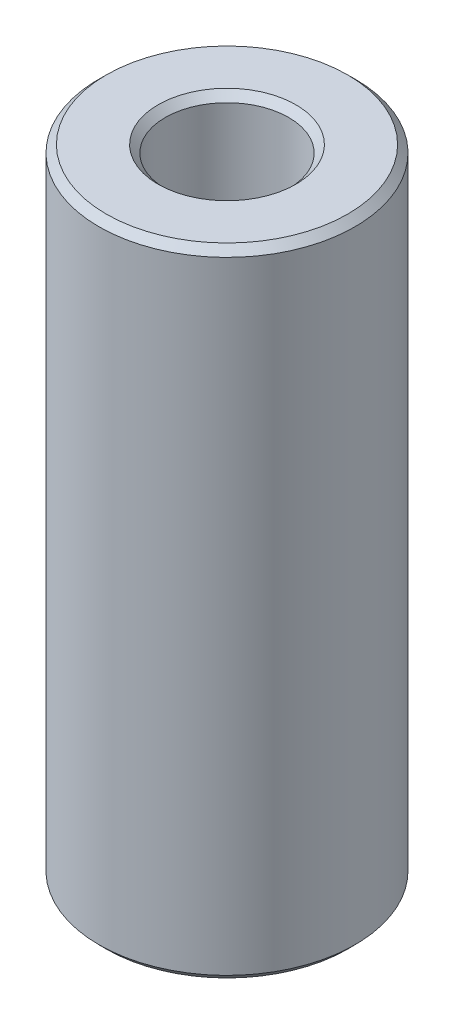
ISO-10303-21;
HEADER;
FILE_DESCRIPTION(('STEP AP214'),'2;1');
FILE_NAME('part.step','',(''),(''),'','','');
FILE_SCHEMA(('AUTOMOTIVE_DESIGN { 1 0 10303 214 1 1 1 1 }'));
ENDSEC;
DATA;
#1=APPLICATION_CONTEXT('core data for automotive mechanical design processes');
#2=APPLICATION_PROTOCOL_DEFINITION('international standard','automotive_design',2000,#1);
#3=PRODUCT_CONTEXT('',#1,'mechanical');
#4=PRODUCT('Part','Part','',(#3));
#5=PRODUCT_RELATED_PRODUCT_CATEGORY('part','',(#4));
#6=PRODUCT_DEFINITION_FORMATION('','',#4);
#7=PRODUCT_DEFINITION_CONTEXT('part definition',#1,'design');
#8=PRODUCT_DEFINITION('design','',#6,#7);
#9=PRODUCT_DEFINITION_SHAPE('','',#8);
#10=(LENGTH_UNIT() NAMED_UNIT(*) SI_UNIT(.MILLI.,.METRE.));
#11=(NAMED_UNIT(*) PLANE_ANGLE_UNIT() SI_UNIT($,.RADIAN.));
#12=(NAMED_UNIT(*) SI_UNIT($,.STERADIAN.) SOLID_ANGLE_UNIT());
#13=UNCERTAINTY_MEASURE_WITH_UNIT(LENGTH_MEASURE(1.E-05),#10,'distance_accuracy_value','');
#14=(GEOMETRIC_REPRESENTATION_CONTEXT(3) GLOBAL_UNCERTAINTY_ASSIGNED_CONTEXT((#13)) GLOBAL_UNIT_ASSIGNED_CONTEXT((#10,
#11,#12)) REPRESENTATION_CONTEXT('',''));
#15=CARTESIAN_POINT('',(0.,0.,0.));
#16=DIRECTION('',(0.,0.,1.));
#17=DIRECTION('',(1.,0.,0.));
#18=AXIS2_PLACEMENT_3D('',#15,#16,#17);
#19=CARTESIAN_POINT('',(0.,211.299643376169,0.));
#20=DIRECTION('',(0.,-1.,0.));
#21=DIRECTION('',(0.,0.,-1.));
#22=AXIS2_PLACEMENT_3D('',#19,#20,#21);
#23=CYLINDRICAL_SURFACE('',#22,42.5);
#24=CARTESIAN_POINT('',(0.,2.44716220224878,0.));
#25=DIRECTION('',(0.,1.,0.));
#26=DIRECTION('',(0.,0.,1.));
#27=AXIS2_PLACEMENT_3D('',#24,#25,#26);
#28=CIRCLE('',#27,42.5);
#29=CARTESIAN_POINT('',(0.,2.44716220224875,-42.5));
#30=VERTEX_POINT('',#29);
#31=EDGE_CURVE('E10',#30,#30,#28,.T.);
#32=CARTESIAN_POINT('',(0.,208.890496954962,0.));
#33=DIRECTION('',(0.,1.,0.));
#34=DIRECTION('',(0.,0.,1.));
#35=AXIS2_PLACEMENT_3D('',#32,#33,#34);
#36=CIRCLE('',#35,42.5);
#37=CARTESIAN_POINT('',(0.,208.890496954962,-42.5));
#38=VERTEX_POINT('',#37);
#39=EDGE_CURVE('E50',#38,#38,#36,.F.);
#40=CARTESIAN_POINT('',(0.,2.44716220224875,-42.5));
#41=CARTESIAN_POINT('',(0.,4.59761360592285,-42.5));
#42=CARTESIAN_POINT('',(0.,6.74806500959695,-42.5));
#43=CARTESIAN_POINT('',(0.,11.0489678169451,-42.5));
#44=CARTESIAN_POINT('',(0.,13.1994192206192,-42.5));
#45=CARTESIAN_POINT('',(0.,17.5003220279674,-42.5));
#46=CARTESIAN_POINT('',(0.,19.6507734316415,-42.5));
#47=CARTESIAN_POINT('',(0.,23.9516762389897,-42.5));
#48=CARTESIAN_POINT('',(0.,26.1021276426638,-42.5));
#49=CARTESIAN_POINT('',(0.,30.403030450012,-42.5));
#50=CARTESIAN_POINT('',(0.,32.5534818536861,-42.5));
#51=CARTESIAN_POINT('',(0.,36.8543846610343,-42.5));
#52=CARTESIAN_POINT('',(0.,39.0048360647084,-42.5));
#53=CARTESIAN_POINT('',(0.,43.3057388720566,-42.5));
#54=CARTESIAN_POINT('',(0.,45.4561902757307,-42.5));
#55=CARTESIAN_POINT('',(0.,49.7570930830789,-42.5));
#56=CARTESIAN_POINT('',(0.,51.907544486753,-42.5));
#57=CARTESIAN_POINT('',(0.,56.2084472941012,-42.5));
#58=CARTESIAN_POINT('',(0.,58.3588986977753,-42.5));
#59=CARTESIAN_POINT('',(0.,62.6598015051235,-42.5));
#60=CARTESIAN_POINT('',(0.,64.8102529087976,-42.5));
#61=CARTESIAN_POINT('',(0.,69.1111557161458,-42.5));
#62=CARTESIAN_POINT('',(0.,71.2616071198199,-42.5));
#63=CARTESIAN_POINT('',(0.,75.5625099271681,-42.5));
#64=CARTESIAN_POINT('',(0.,77.7129613308422,-42.5));
#65=CARTESIAN_POINT('',(0.,82.0138641381904,-42.5));
#66=CARTESIAN_POINT('',(0.,84.1643155418645,-42.5));
#67=CARTESIAN_POINT('',(0.,88.4652183492127,-42.5));
#68=CARTESIAN_POINT('',(0.,90.6156697528868,-42.5));
#69=CARTESIAN_POINT('',(0.,94.916572560235,-42.5));
#70=CARTESIAN_POINT('',(0.,97.0670239639091,-42.5));
#71=CARTESIAN_POINT('',(0.,101.367926771257,-42.5));
#72=CARTESIAN_POINT('',(0.,103.518378174931,-42.5));
#73=CARTESIAN_POINT('',(0.,107.81928098228,-42.5));
#74=CARTESIAN_POINT('',(0.,109.969732385954,-42.5));
#75=CARTESIAN_POINT('',(0.,114.270635193302,-42.5));
#76=CARTESIAN_POINT('',(0.,116.421086596976,-42.5));
#77=CARTESIAN_POINT('',(0.,120.721989404324,-42.5));
#78=CARTESIAN_POINT('',(0.,122.872440807998,-42.5));
#79=CARTESIAN_POINT('',(0.,127.173343615346,-42.5));
#80=CARTESIAN_POINT('',(0.,129.323795019021,-42.5));
#81=CARTESIAN_POINT('',(0.,133.624697826369,-42.5));
#82=CARTESIAN_POINT('',(0.,135.775149230043,-42.5));
#83=CARTESIAN_POINT('',(0.,140.076052037391,-42.5));
#84=CARTESIAN_POINT('',(0.,142.226503441065,-42.5));
#85=CARTESIAN_POINT('',(0.,146.527406248413,-42.5));
#86=CARTESIAN_POINT('',(0.,148.677857652087,-42.5));
#87=CARTESIAN_POINT('',(0.,152.978760459436,-42.5));
#88=CARTESIAN_POINT('',(0.,155.12921186311,-42.5));
#89=CARTESIAN_POINT('',(0.,159.430114670458,-42.5));
#90=CARTESIAN_POINT('',(0.,161.580566074132,-42.5));
#91=CARTESIAN_POINT('',(0.,165.88146888148,-42.5));
#92=CARTESIAN_POINT('',(0.,168.031920285154,-42.5));
#93=CARTESIAN_POINT('',(0.,172.332823092502,-42.5));
#94=CARTESIAN_POINT('',(0.,174.483274496177,-42.5));
#95=CARTESIAN_POINT('',(0.,178.784177303525,-42.5));
#96=CARTESIAN_POINT('',(0.,180.934628707199,-42.5));
#97=CARTESIAN_POINT('',(0.,185.235531514547,-42.5));
#98=CARTESIAN_POINT('',(0.,187.385982918221,-42.5));
#99=CARTESIAN_POINT('',(0.,191.686885725569,-42.5));
#100=CARTESIAN_POINT('',(0.,193.837337129243,-42.5));
#101=CARTESIAN_POINT('',(0.,198.138239936592,-42.5));
#102=CARTESIAN_POINT('',(0.,200.288691340266,-42.5));
#103=CARTESIAN_POINT('',(0.,204.589594147614,-42.5));
#104=CARTESIAN_POINT('',(0.,206.740045551288,-42.5));
#105=CARTESIAN_POINT('',(0.,208.890496954962,-42.5));
#106=B_SPLINE_CURVE_WITH_KNOTS('',3,(#40,#41,#42,#43,#44,#45,#46,#47,#48,#49,#50,#51,#52,#53,
#54,#55,#56,#57,#58,#59,#60,#61,#62,#63,#64,#65,#66,#67,#68,#69,#70,#71,#72,#73,#74,#75,#76,#77,
#78,#79,#80,#81,#82,#83,#84,#85,#86,#87,#88,#89,#90,#91,#92,#93,#94,#95,#96,#97,#98,#99,#100,
#101,#102,#103,#104,#105),.UNSPECIFIED.,.F.,.F.,(4,2,2,2,2,2,2,2,2,2,2,2,2,2,2,2,2,2,2,2,2,2,2,
2,2,2,2,2,2,2,2,2,4),(0.,6.4513542110223,12.9027084220446,19.3540626330669,25.8054168440892,
32.2567710551115,38.7081252661338,45.1594794771561,51.6108336881784,58.0621878992006,
64.5135421102229,70.9648963212452,77.4162505322675,83.8676047432898,90.3189589543121,
96.7703131653344,103.221667376357,109.673021587379,116.124375798401,122.575730009424,
129.027084220446,135.478438431468,141.92979264249,148.381146853513,154.832501064535,
161.283855275557,167.73520948658,174.186563697602,180.637917908624,187.089272119647,
193.540626330669,199.991980541691,206.443334752713),.UNSPECIFIED.);
#107=EDGE_CURVE('BSEAM39',#30,#38,#106,.T.);
#108=ORIENTED_EDGE('',*,*,#31,.T.);
#109=ORIENTED_EDGE('',*,*,#39,.T.);
#110=ORIENTED_EDGE('',*,*,#107,.T.);
#111=ORIENTED_EDGE('',*,*,#107,.F.);
#112=EDGE_LOOP('',(#108,#110,#109,#111));
#113=FACE_BOUND('',#112,.T.);
#114=ADVANCED_FACE('F39',(#113),#23,.T.);
#115=CARTESIAN_POINT('',(0.,211.299643376169,0.));
#116=DIRECTION('',(0.,1.,0.));
#117=DIRECTION('',(0.,0.,1.));
#118=AXIS2_PLACEMENT_3D('',#115,#116,#117);
#119=PLANE('',#118);
#120=CARTESIAN_POINT('',(0.,211.299643376169,0.));
#121=DIRECTION('',(0.,1.,0.));
#122=DIRECTION('',(0.,0.,1.));
#123=AXIS2_PLACEMENT_3D('',#120,#121,#122);
#124=CIRCLE('',#123,22.8783251566095);
#125=CARTESIAN_POINT('',(0.,211.299643376169,22.8783251566095));
#126=VERTEX_POINT('',#125);
#127=EDGE_CURVE('E58',#126,#126,#124,.F.);
#128=ORIENTED_EDGE('',*,*,#127,.T.);
#129=EDGE_LOOP('',(#128));
#130=FACE_BOUND('',#129,.T.);
#131=CARTESIAN_POINT('',(0.,211.299643376169,0.));
#132=DIRECTION('',(0.,1.,0.));
#133=DIRECTION('',(0.,0.,1.));
#134=AXIS2_PLACEMENT_3D('',#131,#132,#133);
#135=CIRCLE('',#134,40.0528377977515);
#136=CARTESIAN_POINT('',(0.,211.299643376169,40.0528377977515));
#137=VERTEX_POINT('',#136);
#138=EDGE_CURVE('E61',#137,#137,#135,.T.);
#139=ORIENTED_EDGE('',*,*,#138,.T.);
#140=EDGE_LOOP('',(#139));
#141=FACE_BOUND('',#140,.T.);
#142=ADVANCED_FACE('F88',(#130,#141),#119,.T.);
#143=CARTESIAN_POINT('',(0.,0.,0.));
#144=DIRECTION('',(0.,1.,0.));
#145=DIRECTION('',(0.,0.,1.));
#146=AXIS2_PLACEMENT_3D('',#143,#144,#145);
#147=PLANE('',#146);
#148=CARTESIAN_POINT('',(0.,0.,0.));
#149=DIRECTION('',(0.,1.,0.));
#150=DIRECTION('',(0.,0.,1.));
#151=AXIS2_PLACEMENT_3D('',#148,#149,#150);
#152=CIRCLE('',#151,22.9163409376507);
#153=CARTESIAN_POINT('',(0.,0.,-22.9163409376507));
#154=VERTEX_POINT('',#153);
#155=EDGE_CURVE('E51',#154,#154,#152,.T.);
#156=ORIENTED_EDGE('',*,*,#155,.T.);
#157=EDGE_LOOP('',(#156));
#158=FACE_BOUND('',#157,.T.);
#159=CARTESIAN_POINT('',(0.,0.,0.));
#160=DIRECTION('',(0.,1.,0.));
#161=DIRECTION('',(0.,0.,1.));
#162=AXIS2_PLACEMENT_3D('',#159,#160,#161);
#163=CIRCLE('',#162,40.0908535787925);
#164=CARTESIAN_POINT('',(0.,0.,40.0908535787925));
#165=VERTEX_POINT('',#164);
#166=EDGE_CURVE('E54',#165,#165,#163,.F.);
#167=ORIENTED_EDGE('',*,*,#166,.T.);
#168=EDGE_LOOP('',(#167));
#169=FACE_BOUND('',#168,.T.);
#170=ADVANCED_FACE('F83',(#158,#169),#147,.F.);
#171=CARTESIAN_POINT('',(0.,211.299643376169,0.));
#172=DIRECTION('',(0.,-1.,0.));
#173=DIRECTION('',(0.,0.,-1.));
#174=AXIS2_PLACEMENT_3D('',#171,#172,#173);
#175=CYLINDRICAL_SURFACE('',#174,20.4691787354021);
#176=CARTESIAN_POINT('',(0.,208.852481173921,0.));
#177=DIRECTION('',(0.,1.,0.));
#178=DIRECTION('',(0.,0.,1.));
#179=AXIS2_PLACEMENT_3D('',#176,#177,#178);
#180=CIRCLE('',#179,20.4691787354021);
#181=CARTESIAN_POINT('',(0.,208.852481173921,-20.4691787354021));
#182=VERTEX_POINT('',#181);
#183=EDGE_CURVE('E67',#182,#182,#180,.T.);
#184=CARTESIAN_POINT('',(0.,2.40914642120735,0.));
#185=DIRECTION('',(0.,1.,0.));
#186=DIRECTION('',(0.,0.,1.));
#187=AXIS2_PLACEMENT_3D('',#184,#185,#186);
#188=CIRCLE('',#187,20.4691787354021);
#189=CARTESIAN_POINT('',(0.,2.40914642120735,-20.4691787354021));
#190=VERTEX_POINT('',#189);
#191=EDGE_CURVE('E69',#190,#190,#188,.F.);
#192=CARTESIAN_POINT('',(0.,208.852481173921,-20.4691787354021));
#193=CARTESIAN_POINT('',(0.,206.702029770247,-20.4691787354021));
#194=CARTESIAN_POINT('',(0.,204.551578366572,-20.4691787354021));
#195=CARTESIAN_POINT('',(0.,200.250675559224,-20.4691787354021));
#196=CARTESIAN_POINT('',(0.,198.10022415555,-20.4691787354021));
#197=CARTESIAN_POINT('',(0.,193.799321348202,-20.4691787354021));
#198=CARTESIAN_POINT('',(0.,191.648869944528,-20.4691787354021));
#199=CARTESIAN_POINT('',(0.,187.34796713718,-20.4691787354021));
#200=CARTESIAN_POINT('',(0.,185.197515733506,-20.4691787354021));
#201=CARTESIAN_POINT('',(0.,180.896612926157,-20.4691787354021));
#202=CARTESIAN_POINT('',(0.,178.746161522483,-20.4691787354021));
#203=CARTESIAN_POINT('',(0.,174.445258715135,-20.4691787354021));
#204=CARTESIAN_POINT('',(0.,172.294807311461,-20.4691787354021));
#205=CARTESIAN_POINT('',(0.,167.993904504113,-20.4691787354021));
#206=CARTESIAN_POINT('',(0.,165.843453100439,-20.4691787354021));
#207=CARTESIAN_POINT('',(0.,161.542550293091,-20.4691787354021));
#208=CARTESIAN_POINT('',(0.,159.392098889416,-20.4691787354021));
#209=CARTESIAN_POINT('',(0.,155.091196082068,-20.4691787354021));
#210=CARTESIAN_POINT('',(0.,152.940744678394,-20.4691787354021));
#211=CARTESIAN_POINT('',(0.,148.639841871046,-20.4691787354021));
#212=CARTESIAN_POINT('',(0.,146.489390467372,-20.4691787354021));
#213=CARTESIAN_POINT('',(0.,142.188487660024,-20.4691787354021));
#214=CARTESIAN_POINT('',(0.,140.03803625635,-20.4691787354021));
#215=CARTESIAN_POINT('',(0.,135.737133449001,-20.4691787354021));
#216=CARTESIAN_POINT('',(0.,133.586682045327,-20.4691787354021));
#217=CARTESIAN_POINT('',(0.,129.285779237979,-20.4691787354021));
#218=CARTESIAN_POINT('',(0.,127.135327834305,-20.4691787354021));
#219=CARTESIAN_POINT('',(0.,122.834425026957,-20.4691787354021));
#220=CARTESIAN_POINT('',(0.,120.683973623283,-20.4691787354021));
#221=CARTESIAN_POINT('',(0.,116.383070815935,-20.4691787354021));
#222=CARTESIAN_POINT('',(0.,114.23261941226,-20.4691787354021));
#223=CARTESIAN_POINT('',(0.,109.931716604912,-20.4691787354021));
#224=CARTESIAN_POINT('',(0.,107.781265201238,-20.4691787354021));
#225=CARTESIAN_POINT('',(0.,103.48036239389,-20.4691787354021));
#226=CARTESIAN_POINT('',(0.,101.329910990216,-20.4691787354021));
#227=CARTESIAN_POINT('',(0.,97.0290081828677,-20.4691787354021));
#228=CARTESIAN_POINT('',(0.,94.8785567791935,-20.4691787354021));
#229=CARTESIAN_POINT('',(0.,90.5776539718454,-20.4691787354021));
#230=CARTESIAN_POINT('',(0.,88.4272025681713,-20.4691787354021));
#231=CARTESIAN_POINT('',(0.,84.1262997608231,-20.4691787354021));
#232=CARTESIAN_POINT('',(0.,81.975848357149,-20.4691787354021));
#233=CARTESIAN_POINT('',(0.,77.6749455498008,-20.4691787354021));
#234=CARTESIAN_POINT('',(0.,75.5244941461267,-20.4691787354021));
#235=CARTESIAN_POINT('',(0.,71.2235913387785,-20.4691787354021));
#236=CARTESIAN_POINT('',(0.,69.0731399351044,-20.4691787354021));
#237=CARTESIAN_POINT('',(0.,64.7722371277562,-20.4691787354021));
#238=CARTESIAN_POINT('',(0.,62.6217857240821,-20.4691787354021));
#239=CARTESIAN_POINT('',(0.,58.3208829167339,-20.4691787354021));
#240=CARTESIAN_POINT('',(0.,56.1704315130598,-20.4691787354021));
#241=CARTESIAN_POINT('',(0.,51.8695287057116,-20.4691787354021));
#242=CARTESIAN_POINT('',(0.,49.7190773020375,-20.4691787354021));
#243=CARTESIAN_POINT('',(0.,45.4181744946893,-20.4691787354021));
#244=CARTESIAN_POINT('',(0.,43.2677230910152,-20.4691787354021));
#245=CARTESIAN_POINT('',(0.,38.966820283667,-20.4691787354021));
#246=CARTESIAN_POINT('',(0.,36.8163688799929,-20.4691787354021));
#247=CARTESIAN_POINT('',(0.,32.5154660726447,-20.4691787354021));
#248=CARTESIAN_POINT('',(0.,30.3650146689706,-20.4691787354021));
#249=CARTESIAN_POINT('',(0.,26.0641118616224,-20.4691787354021));
#250=CARTESIAN_POINT('',(0.,23.9136604579483,-20.4691787354021));
#251=CARTESIAN_POINT('',(0.,19.6127576506001,-20.4691787354021));
#252=CARTESIAN_POINT('',(0.,17.462306246926,-20.4691787354021));
#253=CARTESIAN_POINT('',(0.,13.1614034395779,-20.4691787354021));
#254=CARTESIAN_POINT('',(0.,11.0109520359038,-20.4691787354021));
#255=CARTESIAN_POINT('',(0.,6.71004922855557,-20.4691787354021));
#256=CARTESIAN_POINT('',(0.,4.55959782488146,-20.4691787354021));
#257=CARTESIAN_POINT('',(0.,2.40914642120735,-20.4691787354021));
#258=B_SPLINE_CURVE_WITH_KNOTS('',3,(#192,#193,#194,#195,#196,#197,#198,#199,#200,#201,#202,
#203,#204,#205,#206,#207,#208,#209,#210,#211,#212,#213,#214,#215,#216,#217,#218,#219,#220,#221,
#222,#223,#224,#225,#226,#227,#228,#229,#230,#231,#232,#233,#234,#235,#236,#237,#238,#239,#240,
#241,#242,#243,#244,#245,#246,#247,#248,#249,#250,#251,#252,#253,#254,#255,#256,#257),
.UNSPECIFIED.,.F.,.F.,(4,2,2,2,2,2,2,2,2,2,2,2,2,2,2,2,2,2,2,2,2,2,2,2,2,2,2,2,2,2,2,2,4),(0.,
6.4513542110223,12.9027084220446,19.3540626330669,25.8054168440892,32.2567710551115,
38.7081252661338,45.1594794771561,51.6108336881783,58.0621878992006,64.5135421102229,
70.9648963212452,77.4162505322675,83.8676047432898,90.3189589543121,96.7703131653344,
103.221667376357,109.673021587379,116.124375798401,122.575730009424,129.027084220446,
135.478438431468,141.92979264249,148.381146853513,154.832501064535,161.283855275557,
167.73520948658,174.186563697602,180.637917908624,187.089272119646,193.540626330669,
199.991980541691,206.443334752713),.UNSPECIFIED.);
#259=EDGE_CURVE('BSEAM71',#182,#190,#258,.T.);
#260=ORIENTED_EDGE('',*,*,#183,.T.);
#261=ORIENTED_EDGE('',*,*,#191,.T.);
#262=ORIENTED_EDGE('',*,*,#259,.T.);
#263=ORIENTED_EDGE('',*,*,#259,.F.);
#264=EDGE_LOOP('',(#260,#262,#261,#263));
#265=FACE_BOUND('',#264,.T.);
#266=ADVANCED_FACE('F71',(#265),#175,.F.);
#267=CARTESIAN_POINT('',(0.,208.852481173921,0.));
#268=DIRECTION('',(0.,1.,0.));
#269=DIRECTION('',(0.,0.,1.));
#270=AXIS2_PLACEMENT_3D('',#267,#268,#269);
#271=CONICAL_SURFACE('',#270,20.4691787354021,0.77757020033169);
#272=ORIENTED_EDGE('',*,*,#127,.F.);
#273=EDGE_LOOP('',(#272));
#274=FACE_BOUND('',#273,.T.);
#275=ORIENTED_EDGE('',*,*,#183,.F.);
#276=EDGE_LOOP('',(#275));
#277=FACE_BOUND('',#276,.T.);
#278=ADVANCED_FACE('F77',(#274,#277),#271,.F.);
#279=CARTESIAN_POINT('',(0.,0.,0.));
#280=DIRECTION('',(0.,-1.,0.));
#281=DIRECTION('',(0.,0.,-1.));
#282=AXIS2_PLACEMENT_3D('',#279,#280,#281);
#283=CONICAL_SURFACE('',#282,22.9163409376507,0.793226126463198);
#284=CARTESIAN_POINT('',(0.,2.40914642120735,-20.4691787354021));
#285=CARTESIAN_POINT('',(0.,2.38405114598644,-20.4946700083422));
#286=CARTESIAN_POINT('',(0.,2.35895587076553,-20.5201612812823));
#287=CARTESIAN_POINT('',(0.,2.30876532032371,-20.5711438271625));
#288=CARTESIAN_POINT('',(0.,2.2836700451028,-20.5966351001025));
#289=CARTESIAN_POINT('',(0.,2.23347949466098,-20.6476176459827));
#290=CARTESIAN_POINT('',(0.,2.20838421944007,-20.6731089189228));
#291=CARTESIAN_POINT('',(0.,2.15819366899825,-20.724091464803));
#292=CARTESIAN_POINT('',(0.,2.13309839377734,-20.7495827377431));
#293=CARTESIAN_POINT('',(0.,2.08290784333552,-20.8005652836233));
#294=CARTESIAN_POINT('',(0.,2.05781256811461,-20.8260565565633));
#295=CARTESIAN_POINT('',(0.,2.00762201767279,-20.8770391024435));
#296=CARTESIAN_POINT('',(0.,1.98252674245188,-20.9025303753836));
#297=CARTESIAN_POINT('',(0.,1.93233619201006,-20.9535129212638));
#298=CARTESIAN_POINT('',(0.,1.90724091678915,-20.9790041942039));
#299=CARTESIAN_POINT('',(0.,1.85705036634733,-21.0299867400841));
#300=CARTESIAN_POINT('',(0.,1.83195509112642,-21.0554780130241));
#301=CARTESIAN_POINT('',(0.,1.7817645406846,-21.1064605589043));
#302=CARTESIAN_POINT('',(0.,1.75666926546369,-21.1319518318444));
#303=CARTESIAN_POINT('',(0.,1.70647871502187,-21.1829343777246));
#304=CARTESIAN_POINT('',(0.,1.68138343980096,-21.2084256506647));
#305=CARTESIAN_POINT('',(0.,1.63119288935914,-21.2594081965449));
#306=CARTESIAN_POINT('',(0.,1.60609761413823,-21.2848994694849));
#307=CARTESIAN_POINT('',(0.,1.55590706369641,-21.3358820153651));
#308=CARTESIAN_POINT('',(0.,1.5308117884755,-21.3613732883052));
#309=CARTESIAN_POINT('',(0.,1.48062123803368,-21.4123558341854));
#310=CARTESIAN_POINT('',(0.,1.45552596281277,-21.4378471071255));
#311=CARTESIAN_POINT('',(0.,1.40533541237095,-21.4888296530057));
#312=CARTESIAN_POINT('',(0.,1.38024013715004,-21.5143209259457));
#313=CARTESIAN_POINT('',(0.,1.33004958670822,-21.5653034718259));
#314=CARTESIAN_POINT('',(0.,1.30495431148731,-21.590794744766));
#315=CARTESIAN_POINT('',(0.,1.25476376104549,-21.6417772906462));
#316=CARTESIAN_POINT('',(0.,1.22966848582458,-21.6672685635863));
#317=CARTESIAN_POINT('',(0.,1.17947793538276,-21.7182511094665));
#318=CARTESIAN_POINT('',(0.,1.15438266016185,-21.7437423824066));
#319=CARTESIAN_POINT('',(0.,1.10419210972003,-21.7947249282867));
#320=CARTESIAN_POINT('',(0.,1.07909683449912,-21.8202162012268));
#321=CARTESIAN_POINT('',(0.,1.0289062840573,-21.871198747107));
#322=CARTESIAN_POINT('',(0.,1.00381100883639,-21.8966900200471));
#323=CARTESIAN_POINT('',(0.,0.953620458394575,-21.9476725659273));
#324=CARTESIAN_POINT('',(0.,0.928525183173665,-21.9731638388674));
#325=CARTESIAN_POINT('',(0.,0.878334632731845,-22.0241463847475));
#326=CARTESIAN_POINT('',(0.,0.853239357510936,-22.0496376576876));
#327=CARTESIAN_POINT('',(0.,0.803048807069116,-22.1006202035678));
#328=CARTESIAN_POINT('',(0.,0.777953531848206,-22.1261114765079));
#329=CARTESIAN_POINT('',(0.,0.727762981406386,-22.1770940223881));
#330=CARTESIAN_POINT('',(0.,0.702667706185477,-22.2025852953282));
#331=CARTESIAN_POINT('',(0.,0.652477155743657,-22.2535678412083));
#332=CARTESIAN_POINT('',(0.,0.627381880522746,-22.2790591141484));
#333=CARTESIAN_POINT('',(0.,0.577191330080926,-22.3300416600286));
#334=CARTESIAN_POINT('',(0.,0.552096054860017,-22.3555329329687));
#335=CARTESIAN_POINT('',(0.,0.501905504418197,-22.4065154788489));
#336=CARTESIAN_POINT('',(0.,0.476810229197288,-22.432006751789));
#337=CARTESIAN_POINT('',(0.,0.426619678755468,-22.4829892976691));
#338=CARTESIAN_POINT('',(0.,0.401524403534558,-22.5084805706092));
#339=CARTESIAN_POINT('',(0.,0.351333853092738,-22.5594631164894));
#340=CARTESIAN_POINT('',(0.,0.326238577871829,-22.5849543894295));
#341=CARTESIAN_POINT('',(0.,0.276048027430009,-22.6359369353097));
#342=CARTESIAN_POINT('',(0.,0.250952752209098,-22.6614282082498));
#343=CARTESIAN_POINT('',(0.,0.200762201767279,-22.7124107541299));
#344=CARTESIAN_POINT('',(0.,0.175666926546369,-22.73790202707));
#345=CARTESIAN_POINT('',(0.,0.12547637610455,-22.7888845729502));
#346=CARTESIAN_POINT('',(0.,0.10038110088364,-22.8143758458903));
#347=CARTESIAN_POINT('',(0.,0.0501905504418191,-22.8653583917705));
#348=CARTESIAN_POINT('',(0.,0.0250952752209089,-22.8908496647106));
#349=CARTESIAN_POINT('',(0.,0.,-22.9163409376507));
#350=B_SPLINE_CURVE_WITH_KNOTS('',3,(#284,#285,#286,#287,#288,#289,#290,#291,#292,#293,#294,
#295,#296,#297,#298,#299,#300,#301,#302,#303,#304,#305,#306,#307,#308,#309,#310,#311,#312,#313,
#314,#315,#316,#317,#318,#319,#320,#321,#322,#323,#324,#325,#326,#327,#328,#329,#330,#331,#332,
#333,#334,#335,#336,#337,#338,#339,#340,#341,#342,#343,#344,#345,#346,#347,#348,#349),
.UNSPECIFIED.,.F.,.F.,(4,2,2,2,2,2,2,2,2,2,2,2,2,2,2,2,2,2,2,2,2,2,2,2,2,2,2,2,2,2,2,2,4),(0.,
0.107313561634466,0.214627123268929,0.321940684903394,0.429254246537858,0.536567808172323,
0.643881369806786,0.751194931441252,0.858508493075718,0.965822054710181,1.07313561634465,
1.18044917797911,1.28776273961358,1.39507630124804,1.5023898628825,1.60970342451697,
1.71701698615143,1.8243305477859,1.93164410942036,2.03895767105483,2.14627123268929,
2.25358479432376,2.36089835595822,2.46821191759268,2.57552547922715,2.68283904086161,
2.79015260249608,2.89746616413054,3.00477972576501,3.11209328739947,3.21940684903394,
3.3267204106684,3.43403397230286),.UNSPECIFIED.);
#351=EDGE_CURVE('BSEAM73',#190,#154,#350,.T.);
#352=ORIENTED_EDGE('',*,*,#191,.F.);
#353=ORIENTED_EDGE('',*,*,#155,.F.);
#354=ORIENTED_EDGE('',*,*,#351,.T.);
#355=ORIENTED_EDGE('',*,*,#351,.F.);
#356=EDGE_LOOP('',(#352,#354,#353,#355));
#357=FACE_BOUND('',#356,.T.);
#358=ADVANCED_FACE('F73',(#357),#283,.F.);
#359=CARTESIAN_POINT('',(0.,2.44716220224878,0.));
#360=DIRECTION('',(0.,1.,0.));
#361=DIRECTION('',(0.,0.,1.));
#362=AXIS2_PLACEMENT_3D('',#359,#360,#361);
#363=CONICAL_SURFACE('',#362,42.5,0.777570200331696);
#364=ORIENTED_EDGE('',*,*,#166,.F.);
#365=EDGE_LOOP('',(#364));
#366=FACE_BOUND('',#365,.T.);
#367=ORIENTED_EDGE('',*,*,#31,.F.);
#368=EDGE_LOOP('',(#367));
#369=FACE_BOUND('',#368,.T.);
#370=ADVANCED_FACE('F76',(#366,#369),#363,.T.);
#371=CARTESIAN_POINT('',(0.,211.299643376169,0.));
#372=DIRECTION('',(0.,-1.,0.));
#373=DIRECTION('',(0.,0.,-1.));
#374=AXIS2_PLACEMENT_3D('',#371,#372,#373);
#375=CONICAL_SURFACE('',#374,40.0528377977515,0.793226126463216);
#376=ORIENTED_EDGE('',*,*,#39,.F.);
#377=EDGE_LOOP('',(#376));
#378=FACE_BOUND('',#377,.T.);
#379=ORIENTED_EDGE('',*,*,#138,.F.);
#380=EDGE_LOOP('',(#379));
#381=FACE_BOUND('',#380,.T.);
#382=ADVANCED_FACE('F45',(#378,#381),#375,.T.);
#383=CLOSED_SHELL('',(#114,#142,#170,#266,#278,#358,#370,#382));
#384=MANIFOLD_SOLID_BREP('B2',#383);
#385=ADVANCED_BREP_SHAPE_REPRESENTATION('',(#18,#384),#14);
#386=SHAPE_DEFINITION_REPRESENTATION(#9,#385);
ENDSEC;
END-ISO-10303-21;
